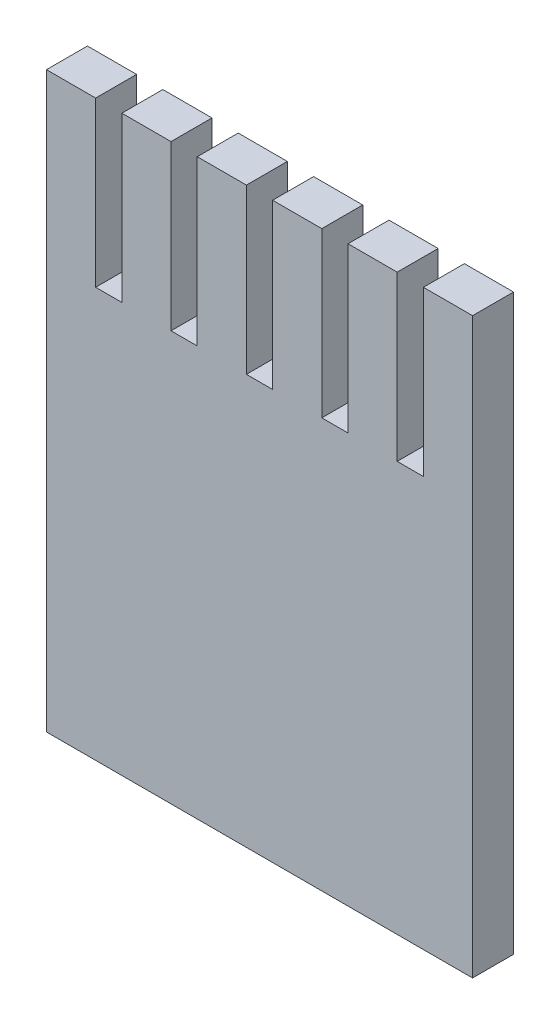
ISO-10303-21;
HEADER;
FILE_DESCRIPTION(('STEP AP214'),'2;1');
FILE_NAME('part.step','',(''),(''),'','','');
FILE_SCHEMA(('AUTOMOTIVE_DESIGN { 1 0 10303 214 1 1 1 1 }'));
ENDSEC;
DATA;
#1=APPLICATION_CONTEXT('core data for automotive mechanical design processes');
#2=APPLICATION_PROTOCOL_DEFINITION('international standard','automotive_design',2000,#1);
#3=PRODUCT_CONTEXT('',#1,'mechanical');
#4=PRODUCT('Part','Part','',(#3));
#5=PRODUCT_RELATED_PRODUCT_CATEGORY('part','',(#4));
#6=PRODUCT_DEFINITION_FORMATION('','',#4);
#7=PRODUCT_DEFINITION_CONTEXT('part definition',#1,'design');
#8=PRODUCT_DEFINITION('design','',#6,#7);
#9=PRODUCT_DEFINITION_SHAPE('','',#8);
#10=(LENGTH_UNIT() NAMED_UNIT(*) SI_UNIT(.MILLI.,.METRE.));
#11=(NAMED_UNIT(*) PLANE_ANGLE_UNIT() SI_UNIT($,.RADIAN.));
#12=(NAMED_UNIT(*) SI_UNIT($,.STERADIAN.) SOLID_ANGLE_UNIT());
#13=UNCERTAINTY_MEASURE_WITH_UNIT(LENGTH_MEASURE(1.E-05),#10,'distance_accuracy_value','');
#14=(GEOMETRIC_REPRESENTATION_CONTEXT(3) GLOBAL_UNCERTAINTY_ASSIGNED_CONTEXT((#13)) GLOBAL_UNIT_ASSIGNED_CONTEXT((#10,
#11,#12)) REPRESENTATION_CONTEXT('',''));
#15=CARTESIAN_POINT('',(0.,0.,0.));
#16=DIRECTION('',(0.,0.,1.));
#17=DIRECTION('',(1.,0.,0.));
#18=AXIS2_PLACEMENT_3D('',#15,#16,#17);
#19=CARTESIAN_POINT('',(0.,0.,2.5));
#20=DIRECTION('',(0.,1.,0.));
#21=DIRECTION('',(0.,0.,1.));
#22=AXIS2_PLACEMENT_3D('',#19,#20,#21);
#23=PLANE('',#22);
#24=DIRECTION('',(1.,0.,0.));
#25=VECTOR('',#24,1.);
#26=CARTESIAN_POINT('',(0.,0.,0.));
#27=LINE('',#26,#25);
#28=CARTESIAN_POINT('',(0.,0.,0.));
#29=VERTEX_POINT('',#28);
#30=CARTESIAN_POINT('',(26.,0.,0.));
#31=VERTEX_POINT('',#30);
#32=EDGE_CURVE('E238',#29,#31,#27,.T.);
#33=ORIENTED_EDGE('',*,*,#32,.T.);
#34=DIRECTION('',(0.,0.,-1.));
#35=VECTOR('',#34,1.);
#36=CARTESIAN_POINT('',(26.,0.,2.5));
#37=LINE('',#36,#35);
#38=CARTESIAN_POINT('',(26.,0.,2.5));
#39=VERTEX_POINT('',#38);
#40=EDGE_CURVE('E11',#39,#31,#37,.T.);
#41=ORIENTED_EDGE('',*,*,#40,.F.);
#42=DIRECTION('',(1.,0.,0.));
#43=VECTOR('',#42,1.);
#44=CARTESIAN_POINT('',(0.,0.,2.5));
#45=LINE('',#44,#43);
#46=CARTESIAN_POINT('',(0.,0.,2.5));
#47=VERTEX_POINT('',#46);
#48=EDGE_CURVE('E318',#47,#39,#45,.T.);
#49=ORIENTED_EDGE('',*,*,#48,.F.);
#50=DIRECTION('',(0.,0.,-1.));
#51=VECTOR('',#50,1.);
#52=CARTESIAN_POINT('',(0.,0.,2.5));
#53=LINE('',#52,#51);
#54=EDGE_CURVE('E58',#47,#29,#53,.T.);
#55=ORIENTED_EDGE('',*,*,#54,.T.);
#56=EDGE_LOOP('',(#33,#41,#49,#55));
#57=FACE_BOUND('',#56,.T.);
#58=ADVANCED_FACE('F41',(#57),#23,.F.);
#59=CARTESIAN_POINT('',(26.,0.,2.5));
#60=DIRECTION('',(-1.,0.,0.));
#61=DIRECTION('',(0.,0.,1.));
#62=AXIS2_PLACEMENT_3D('',#59,#60,#61);
#63=PLANE('',#62);
#64=DIRECTION('',(0.,1.,0.));
#65=VECTOR('',#64,1.);
#66=CARTESIAN_POINT('',(26.,0.,0.));
#67=LINE('',#66,#65);
#68=CARTESIAN_POINT('',(26.,35.,0.));
#69=VERTEX_POINT('',#68);
#70=EDGE_CURVE('E241',#31,#69,#67,.T.);
#71=ORIENTED_EDGE('',*,*,#70,.T.);
#72=DIRECTION('',(0.,0.,-1.));
#73=VECTOR('',#72,1.);
#74=CARTESIAN_POINT('',(26.,35.,2.5));
#75=LINE('',#74,#73);
#76=CARTESIAN_POINT('',(26.,35.,2.5));
#77=VERTEX_POINT('',#76);
#78=EDGE_CURVE('E50',#77,#69,#75,.T.);
#79=ORIENTED_EDGE('',*,*,#78,.F.);
#80=DIRECTION('',(0.,1.,0.));
#81=VECTOR('',#80,1.);
#82=CARTESIAN_POINT('',(26.,0.,2.5));
#83=LINE('',#82,#81);
#84=EDGE_CURVE('E144',#39,#77,#83,.T.);
#85=ORIENTED_EDGE('',*,*,#84,.F.);
#86=ORIENTED_EDGE('',*,*,#40,.T.);
#87=EDGE_LOOP('',(#71,#79,#85,#86));
#88=FACE_BOUND('',#87,.T.);
#89=ADVANCED_FACE('F385',(#88),#63,.F.);
#90=CARTESIAN_POINT('',(0.,35.,2.5));
#91=DIRECTION('',(0.,1.,0.));
#92=DIRECTION('',(0.,0.,1.));
#93=AXIS2_PLACEMENT_3D('',#90,#91,#92);
#94=PLANE('',#93);
#95=DIRECTION('',(1.,0.,0.));
#96=VECTOR('',#95,1.);
#97=CARTESIAN_POINT('',(0.,35.,0.));
#98=LINE('',#97,#96);
#99=CARTESIAN_POINT('',(23.,35.,0.));
#100=VERTEX_POINT('',#99);
#101=EDGE_CURVE('E245',#100,#69,#98,.T.);
#102=ORIENTED_EDGE('',*,*,#101,.F.);
#103=DIRECTION('',(0.,0.,-1.));
#104=VECTOR('',#103,1.);
#105=CARTESIAN_POINT('',(23.,35.,2.5));
#106=LINE('',#105,#104);
#107=CARTESIAN_POINT('',(23.,35.,2.5));
#108=VERTEX_POINT('',#107);
#109=EDGE_CURVE('E376',#108,#100,#106,.T.);
#110=ORIENTED_EDGE('',*,*,#109,.F.);
#111=DIRECTION('',(1.,0.,0.));
#112=VECTOR('',#111,1.);
#113=CARTESIAN_POINT('',(0.,35.,2.5));
#114=LINE('',#113,#112);
#115=EDGE_CURVE('E384',#108,#77,#114,.T.);
#116=ORIENTED_EDGE('',*,*,#115,.T.);
#117=ORIENTED_EDGE('',*,*,#78,.T.);
#118=EDGE_LOOP('',(#102,#110,#116,#117));
#119=FACE_BOUND('',#118,.T.);
#120=ADVANCED_FACE('F382',(#119),#94,.T.);
#121=CARTESIAN_POINT('',(23.,0.,2.5));
#122=DIRECTION('',(1.,0.,0.));
#123=DIRECTION('',(0.,0.,-1.));
#124=AXIS2_PLACEMENT_3D('',#121,#122,#123);
#125=PLANE('',#124);
#126=DIRECTION('',(0.,-1.,0.));
#127=VECTOR('',#126,1.);
#128=CARTESIAN_POINT('',(23.,0.,0.));
#129=LINE('',#128,#127);
#130=CARTESIAN_POINT('',(23.,25.,0.));
#131=VERTEX_POINT('',#130);
#132=EDGE_CURVE('E249',#100,#131,#129,.T.);
#133=ORIENTED_EDGE('',*,*,#132,.T.);
#134=DIRECTION('',(0.,0.,-1.));
#135=VECTOR('',#134,1.);
#136=CARTESIAN_POINT('',(23.,25.,2.5));
#137=LINE('',#136,#135);
#138=CARTESIAN_POINT('',(23.,25.,2.5));
#139=VERTEX_POINT('',#138);
#140=EDGE_CURVE('E373',#139,#131,#137,.T.);
#141=ORIENTED_EDGE('',*,*,#140,.F.);
#142=DIRECTION('',(0.,-1.,0.));
#143=VECTOR('',#142,1.);
#144=CARTESIAN_POINT('',(23.,0.,2.5));
#145=LINE('',#144,#143);
#146=EDGE_CURVE('E396',#108,#139,#145,.T.);
#147=ORIENTED_EDGE('',*,*,#146,.F.);
#148=ORIENTED_EDGE('',*,*,#109,.T.);
#149=EDGE_LOOP('',(#133,#141,#147,#148));
#150=FACE_BOUND('',#149,.T.);
#151=ADVANCED_FACE('F393',(#150),#125,.F.);
#152=CARTESIAN_POINT('',(0.,25.,2.5));
#153=DIRECTION('',(0.,1.,0.));
#154=DIRECTION('',(0.,0.,1.));
#155=AXIS2_PLACEMENT_3D('',#152,#153,#154);
#156=PLANE('',#155);
#157=DIRECTION('',(1.,0.,0.));
#158=VECTOR('',#157,1.);
#159=CARTESIAN_POINT('',(0.,25.,0.));
#160=LINE('',#159,#158);
#161=CARTESIAN_POINT('',(21.4,25.,0.));
#162=VERTEX_POINT('',#161);
#163=EDGE_CURVE('E253',#162,#131,#160,.T.);
#164=ORIENTED_EDGE('',*,*,#163,.F.);
#165=DIRECTION('',(0.,0.,-1.));
#166=VECTOR('',#165,1.);
#167=CARTESIAN_POINT('',(21.4,25.,2.5));
#168=LINE('',#167,#166);
#169=CARTESIAN_POINT('',(21.4,25.,2.5));
#170=VERTEX_POINT('',#169);
#171=EDGE_CURVE('E370',#170,#162,#168,.T.);
#172=ORIENTED_EDGE('',*,*,#171,.F.);
#173=DIRECTION('',(1.,0.,0.));
#174=VECTOR('',#173,1.);
#175=CARTESIAN_POINT('',(0.,25.,2.5));
#176=LINE('',#175,#174);
#177=EDGE_CURVE('E399',#170,#139,#176,.T.);
#178=ORIENTED_EDGE('',*,*,#177,.T.);
#179=ORIENTED_EDGE('',*,*,#140,.T.);
#180=EDGE_LOOP('',(#164,#172,#178,#179));
#181=FACE_BOUND('',#180,.T.);
#182=ADVANCED_FACE('F550',(#181),#156,.T.);
#183=CARTESIAN_POINT('',(21.4,0.,2.5));
#184=DIRECTION('',(1.,0.,0.));
#185=DIRECTION('',(0.,1.,0.));
#186=AXIS2_PLACEMENT_3D('',#183,#184,#185);
#187=PLANE('',#186);
#188=DIRECTION('',(0.,-1.,0.));
#189=VECTOR('',#188,1.);
#190=CARTESIAN_POINT('',(21.4,0.,0.));
#191=LINE('',#190,#189);
#192=CARTESIAN_POINT('',(21.4,35.,0.));
#193=VERTEX_POINT('',#192);
#194=EDGE_CURVE('E257',#193,#162,#191,.T.);
#195=ORIENTED_EDGE('',*,*,#194,.F.);
#196=DIRECTION('',(0.,0.,-1.));
#197=VECTOR('',#196,1.);
#198=CARTESIAN_POINT('',(21.4,35.,2.5));
#199=LINE('',#198,#197);
#200=CARTESIAN_POINT('',(21.4,35.,2.5));
#201=VERTEX_POINT('',#200);
#202=EDGE_CURVE('E367',#201,#193,#199,.T.);
#203=ORIENTED_EDGE('',*,*,#202,.F.);
#204=DIRECTION('',(0.,-1.,0.));
#205=VECTOR('',#204,1.);
#206=CARTESIAN_POINT('',(21.4,0.,2.5));
#207=LINE('',#206,#205);
#208=EDGE_CURVE('E409',#201,#170,#207,.T.);
#209=ORIENTED_EDGE('',*,*,#208,.T.);
#210=ORIENTED_EDGE('',*,*,#171,.T.);
#211=EDGE_LOOP('',(#195,#203,#209,#210));
#212=FACE_BOUND('',#211,.T.);
#213=ADVANCED_FACE('F548',(#212),#187,.T.);
#214=CARTESIAN_POINT('',(0.,35.,2.5));
#215=DIRECTION('',(0.,1.,0.));
#216=DIRECTION('',(0.,0.,1.));
#217=AXIS2_PLACEMENT_3D('',#214,#215,#216);
#218=PLANE('',#217);
#219=DIRECTION('',(1.,0.,0.));
#220=VECTOR('',#219,1.);
#221=CARTESIAN_POINT('',(0.,35.,0.));
#222=LINE('',#221,#220);
#223=CARTESIAN_POINT('',(18.4,35.,0.));
#224=VERTEX_POINT('',#223);
#225=EDGE_CURVE('E263',#224,#193,#222,.T.);
#226=ORIENTED_EDGE('',*,*,#225,.F.);
#227=DIRECTION('',(0.,0.,-1.));
#228=VECTOR('',#227,1.);
#229=CARTESIAN_POINT('',(18.4,35.,2.5));
#230=LINE('',#229,#228);
#231=CARTESIAN_POINT('',(18.4,35.,2.5));
#232=VERTEX_POINT('',#231);
#233=EDGE_CURVE('E364',#232,#224,#230,.T.);
#234=ORIENTED_EDGE('',*,*,#233,.F.);
#235=DIRECTION('',(1.,0.,0.));
#236=VECTOR('',#235,1.);
#237=CARTESIAN_POINT('',(0.,35.,2.5));
#238=LINE('',#237,#236);
#239=EDGE_CURVE('E414',#232,#201,#238,.T.);
#240=ORIENTED_EDGE('',*,*,#239,.T.);
#241=ORIENTED_EDGE('',*,*,#202,.T.);
#242=EDGE_LOOP('',(#226,#234,#240,#241));
#243=FACE_BOUND('',#242,.T.);
#244=ADVANCED_FACE('F544',(#243),#218,.T.);
#245=CARTESIAN_POINT('',(18.4,0.,2.5));
#246=DIRECTION('',(1.,0.,0.));
#247=DIRECTION('',(0.,0.,-1.));
#248=AXIS2_PLACEMENT_3D('',#245,#246,#247);
#249=PLANE('',#248);
#250=DIRECTION('',(0.,-1.,0.));
#251=VECTOR('',#250,1.);
#252=CARTESIAN_POINT('',(18.4,0.,0.));
#253=LINE('',#252,#251);
#254=CARTESIAN_POINT('',(18.4,25.,0.));
#255=VERTEX_POINT('',#254);
#256=EDGE_CURVE('E267',#224,#255,#253,.T.);
#257=ORIENTED_EDGE('',*,*,#256,.T.);
#258=DIRECTION('',(0.,0.,-1.));
#259=VECTOR('',#258,1.);
#260=CARTESIAN_POINT('',(18.4,25.,2.5));
#261=LINE('',#260,#259);
#262=CARTESIAN_POINT('',(18.4,25.,2.5));
#263=VERTEX_POINT('',#262);
#264=EDGE_CURVE('E361',#263,#255,#261,.T.);
#265=ORIENTED_EDGE('',*,*,#264,.F.);
#266=DIRECTION('',(0.,-1.,0.));
#267=VECTOR('',#266,1.);
#268=CARTESIAN_POINT('',(18.4,0.,2.5));
#269=LINE('',#268,#267);
#270=EDGE_CURVE('E418',#232,#263,#269,.T.);
#271=ORIENTED_EDGE('',*,*,#270,.F.);
#272=ORIENTED_EDGE('',*,*,#233,.T.);
#273=EDGE_LOOP('',(#257,#265,#271,#272));
#274=FACE_BOUND('',#273,.T.);
#275=ADVANCED_FACE('F562',(#274),#249,.F.);
#276=CARTESIAN_POINT('',(16.8,25.,0.));
#277=VERTEX_POINT('',#276);
#278=EDGE_CURVE('E259',#277,#255,#160,.T.);
#279=ORIENTED_EDGE('',*,*,#278,.F.);
#280=DIRECTION('',(0.,0.,-1.));
#281=VECTOR('',#280,1.);
#282=CARTESIAN_POINT('',(16.8,25.,2.5));
#283=LINE('',#282,#281);
#284=CARTESIAN_POINT('',(16.8,25.,2.5));
#285=VERTEX_POINT('',#284);
#286=EDGE_CURVE('E358',#285,#277,#283,.T.);
#287=ORIENTED_EDGE('',*,*,#286,.F.);
#288=EDGE_CURVE('E410',#285,#263,#176,.T.);
#289=ORIENTED_EDGE('',*,*,#288,.T.);
#290=ORIENTED_EDGE('',*,*,#264,.T.);
#291=EDGE_LOOP('',(#279,#287,#289,#290));
#292=FACE_BOUND('',#291,.T.);
#293=ADVANCED_FACE('F472',(#292),#156,.T.);
#294=CARTESIAN_POINT('',(16.8,0.,2.5));
#295=DIRECTION('',(1.,0.,0.));
#296=DIRECTION('',(0.,1.,0.));
#297=AXIS2_PLACEMENT_3D('',#294,#295,#296);
#298=PLANE('',#297);
#299=DIRECTION('',(0.,-1.,0.));
#300=VECTOR('',#299,1.);
#301=CARTESIAN_POINT('',(16.8,0.,0.));
#302=LINE('',#301,#300);
#303=CARTESIAN_POINT('',(16.8,35.,0.));
#304=VERTEX_POINT('',#303);
#305=EDGE_CURVE('E271',#304,#277,#302,.T.);
#306=ORIENTED_EDGE('',*,*,#305,.F.);
#307=DIRECTION('',(0.,0.,-1.));
#308=VECTOR('',#307,1.);
#309=CARTESIAN_POINT('',(16.8,35.,2.5));
#310=LINE('',#309,#308);
#311=CARTESIAN_POINT('',(16.8,35.,2.5));
#312=VERTEX_POINT('',#311);
#313=EDGE_CURVE('E355',#312,#304,#310,.T.);
#314=ORIENTED_EDGE('',*,*,#313,.F.);
#315=DIRECTION('',(0.,-1.,0.));
#316=VECTOR('',#315,1.);
#317=CARTESIAN_POINT('',(16.8,0.,2.5));
#318=LINE('',#317,#316);
#319=EDGE_CURVE('E421',#312,#285,#318,.T.);
#320=ORIENTED_EDGE('',*,*,#319,.T.);
#321=ORIENTED_EDGE('',*,*,#286,.T.);
#322=EDGE_LOOP('',(#306,#314,#320,#321));
#323=FACE_BOUND('',#322,.T.);
#324=ADVANCED_FACE('F480',(#323),#298,.T.);
#325=CARTESIAN_POINT('',(0.,35.,2.5));
#326=DIRECTION('',(0.,1.,0.));
#327=DIRECTION('',(0.,0.,1.));
#328=AXIS2_PLACEMENT_3D('',#325,#326,#327);
#329=PLANE('',#328);
#330=DIRECTION('',(1.,0.,0.));
#331=VECTOR('',#330,1.);
#332=CARTESIAN_POINT('',(0.,35.,0.));
#333=LINE('',#332,#331);
#334=CARTESIAN_POINT('',(13.8,35.,0.));
#335=VERTEX_POINT('',#334);
#336=EDGE_CURVE('E275',#335,#304,#333,.T.);
#337=ORIENTED_EDGE('',*,*,#336,.F.);
#338=DIRECTION('',(0.,0.,-1.));
#339=VECTOR('',#338,1.);
#340=CARTESIAN_POINT('',(13.8,35.,2.5));
#341=LINE('',#340,#339);
#342=CARTESIAN_POINT('',(13.8,35.,2.5));
#343=VERTEX_POINT('',#342);
#344=EDGE_CURVE('E352',#343,#335,#341,.T.);
#345=ORIENTED_EDGE('',*,*,#344,.F.);
#346=DIRECTION('',(1.,0.,0.));
#347=VECTOR('',#346,1.);
#348=CARTESIAN_POINT('',(0.,35.,2.5));
#349=LINE('',#348,#347);
#350=EDGE_CURVE('E425',#343,#312,#349,.T.);
#351=ORIENTED_EDGE('',*,*,#350,.T.);
#352=ORIENTED_EDGE('',*,*,#313,.T.);
#353=EDGE_LOOP('',(#337,#345,#351,#352));
#354=FACE_BOUND('',#353,.T.);
#355=ADVANCED_FACE('F483',(#354),#329,.T.);
#356=CARTESIAN_POINT('',(13.8,0.,2.5));
#357=DIRECTION('',(1.,0.,0.));
#358=DIRECTION('',(0.,0.,-1.));
#359=AXIS2_PLACEMENT_3D('',#356,#357,#358);
#360=PLANE('',#359);
#361=DIRECTION('',(0.,-1.,0.));
#362=VECTOR('',#361,1.);
#363=CARTESIAN_POINT('',(13.8,0.,0.));
#364=LINE('',#363,#362);
#365=CARTESIAN_POINT('',(13.8,25.,0.));
#366=VERTEX_POINT('',#365);
#367=EDGE_CURVE('E279',#335,#366,#364,.T.);
#368=ORIENTED_EDGE('',*,*,#367,.T.);
#369=DIRECTION('',(0.,0.,-1.));
#370=VECTOR('',#369,1.);
#371=CARTESIAN_POINT('',(13.8,25.,2.5));
#372=LINE('',#371,#370);
#373=CARTESIAN_POINT('',(13.8,25.,2.5));
#374=VERTEX_POINT('',#373);
#375=EDGE_CURVE('E349',#374,#366,#372,.T.);
#376=ORIENTED_EDGE('',*,*,#375,.F.);
#377=DIRECTION('',(0.,-1.,0.));
#378=VECTOR('',#377,1.);
#379=CARTESIAN_POINT('',(13.8,0.,2.5));
#380=LINE('',#379,#378);
#381=EDGE_CURVE('E429',#343,#374,#380,.T.);
#382=ORIENTED_EDGE('',*,*,#381,.F.);
#383=ORIENTED_EDGE('',*,*,#344,.T.);
#384=EDGE_LOOP('',(#368,#376,#382,#383));
#385=FACE_BOUND('',#384,.T.);
#386=ADVANCED_FACE('F488',(#385),#360,.F.);
#387=CARTESIAN_POINT('',(12.2,25.,0.));
#388=VERTEX_POINT('',#387);
#389=EDGE_CURVE('E283',#388,#366,#160,.T.);
#390=ORIENTED_EDGE('',*,*,#389,.F.);
#391=DIRECTION('',(0.,0.,-1.));
#392=VECTOR('',#391,1.);
#393=CARTESIAN_POINT('',(12.2,25.,2.5));
#394=LINE('',#393,#392);
#395=CARTESIAN_POINT('',(12.2,25.,2.5));
#396=VERTEX_POINT('',#395);
#397=EDGE_CURVE('E346',#396,#388,#394,.T.);
#398=ORIENTED_EDGE('',*,*,#397,.F.);
#399=EDGE_CURVE('E432',#396,#374,#176,.T.);
#400=ORIENTED_EDGE('',*,*,#399,.T.);
#401=ORIENTED_EDGE('',*,*,#375,.T.);
#402=EDGE_LOOP('',(#390,#398,#400,#401));
#403=FACE_BOUND('',#402,.T.);
#404=ADVANCED_FACE('F492',(#403),#156,.T.);
#405=CARTESIAN_POINT('',(12.2,0.,2.5));
#406=DIRECTION('',(1.,0.,0.));
#407=DIRECTION('',(0.,1.,0.));
#408=AXIS2_PLACEMENT_3D('',#405,#406,#407);
#409=PLANE('',#408);
#410=DIRECTION('',(0.,-1.,0.));
#411=VECTOR('',#410,1.);
#412=CARTESIAN_POINT('',(12.2,0.,0.));
#413=LINE('',#412,#411);
#414=CARTESIAN_POINT('',(12.2,35.,0.));
#415=VERTEX_POINT('',#414);
#416=EDGE_CURVE('E284',#415,#388,#413,.T.);
#417=ORIENTED_EDGE('',*,*,#416,.F.);
#418=DIRECTION('',(0.,0.,-1.));
#419=VECTOR('',#418,1.);
#420=CARTESIAN_POINT('',(12.2,35.,2.5));
#421=LINE('',#420,#419);
#422=CARTESIAN_POINT('',(12.2,35.,2.5));
#423=VERTEX_POINT('',#422);
#424=EDGE_CURVE('E343',#423,#415,#421,.T.);
#425=ORIENTED_EDGE('',*,*,#424,.F.);
#426=DIRECTION('',(0.,-1.,0.));
#427=VECTOR('',#426,1.);
#428=CARTESIAN_POINT('',(12.2,0.,2.5));
#429=LINE('',#428,#427);
#430=EDGE_CURVE('E433',#423,#396,#429,.T.);
#431=ORIENTED_EDGE('',*,*,#430,.T.);
#432=ORIENTED_EDGE('',*,*,#397,.T.);
#433=EDGE_LOOP('',(#417,#425,#431,#432));
#434=FACE_BOUND('',#433,.T.);
#435=ADVANCED_FACE('F498',(#434),#409,.T.);
#436=CARTESIAN_POINT('',(0.,35.,2.5));
#437=DIRECTION('',(0.,1.,0.));
#438=DIRECTION('',(0.,0.,1.));
#439=AXIS2_PLACEMENT_3D('',#436,#437,#438);
#440=PLANE('',#439);
#441=DIRECTION('',(1.,0.,0.));
#442=VECTOR('',#441,1.);
#443=CARTESIAN_POINT('',(0.,35.,0.));
#444=LINE('',#443,#442);
#445=CARTESIAN_POINT('',(9.2,35.,0.));
#446=VERTEX_POINT('',#445);
#447=EDGE_CURVE('E288',#446,#415,#444,.T.);
#448=ORIENTED_EDGE('',*,*,#447,.F.);
#449=DIRECTION('',(0.,0.,-1.));
#450=VECTOR('',#449,1.);
#451=CARTESIAN_POINT('',(9.2,35.,2.5));
#452=LINE('',#451,#450);
#453=CARTESIAN_POINT('',(9.2,35.,2.5));
#454=VERTEX_POINT('',#453);
#455=EDGE_CURVE('E340',#454,#446,#452,.T.);
#456=ORIENTED_EDGE('',*,*,#455,.F.);
#457=DIRECTION('',(1.,0.,0.));
#458=VECTOR('',#457,1.);
#459=CARTESIAN_POINT('',(0.,35.,2.5));
#460=LINE('',#459,#458);
#461=EDGE_CURVE('E437',#454,#423,#460,.T.);
#462=ORIENTED_EDGE('',*,*,#461,.T.);
#463=ORIENTED_EDGE('',*,*,#424,.T.);
#464=EDGE_LOOP('',(#448,#456,#462,#463));
#465=FACE_BOUND('',#464,.T.);
#466=ADVANCED_FACE('F501',(#465),#440,.T.);
#467=CARTESIAN_POINT('',(9.2,0.,2.5));
#468=DIRECTION('',(1.,0.,0.));
#469=DIRECTION('',(0.,0.,-1.));
#470=AXIS2_PLACEMENT_3D('',#467,#468,#469);
#471=PLANE('',#470);
#472=DIRECTION('',(0.,-1.,0.));
#473=VECTOR('',#472,1.);
#474=CARTESIAN_POINT('',(9.2,0.,0.));
#475=LINE('',#474,#473);
#476=CARTESIAN_POINT('',(9.2,25.,0.));
#477=VERTEX_POINT('',#476);
#478=EDGE_CURVE('E292',#446,#477,#475,.T.);
#479=ORIENTED_EDGE('',*,*,#478,.T.);
#480=DIRECTION('',(0.,0.,-1.));
#481=VECTOR('',#480,1.);
#482=CARTESIAN_POINT('',(9.2,25.,2.5));
#483=LINE('',#482,#481);
#484=CARTESIAN_POINT('',(9.2,25.,2.5));
#485=VERTEX_POINT('',#484);
#486=EDGE_CURVE('E337',#485,#477,#483,.T.);
#487=ORIENTED_EDGE('',*,*,#486,.F.);
#488=DIRECTION('',(0.,-1.,0.));
#489=VECTOR('',#488,1.);
#490=CARTESIAN_POINT('',(9.2,0.,2.5));
#491=LINE('',#490,#489);
#492=EDGE_CURVE('E441',#454,#485,#491,.T.);
#493=ORIENTED_EDGE('',*,*,#492,.F.);
#494=ORIENTED_EDGE('',*,*,#455,.T.);
#495=EDGE_LOOP('',(#479,#487,#493,#494));
#496=FACE_BOUND('',#495,.T.);
#497=ADVANCED_FACE('F505',(#496),#471,.F.);
#498=CARTESIAN_POINT('',(7.6,25.,0.));
#499=VERTEX_POINT('',#498);
#500=EDGE_CURVE('E296',#499,#477,#160,.T.);
#501=ORIENTED_EDGE('',*,*,#500,.F.);
#502=DIRECTION('',(0.,0.,-1.));
#503=VECTOR('',#502,1.);
#504=CARTESIAN_POINT('',(7.6,25.,2.5));
#505=LINE('',#504,#503);
#506=CARTESIAN_POINT('',(7.6,25.,2.5));
#507=VERTEX_POINT('',#506);
#508=EDGE_CURVE('E334',#507,#499,#505,.T.);
#509=ORIENTED_EDGE('',*,*,#508,.F.);
#510=EDGE_CURVE('E444',#507,#485,#176,.T.);
#511=ORIENTED_EDGE('',*,*,#510,.T.);
#512=ORIENTED_EDGE('',*,*,#486,.T.);
#513=EDGE_LOOP('',(#501,#509,#511,#512));
#514=FACE_BOUND('',#513,.T.);
#515=ADVANCED_FACE('F564',(#514),#156,.T.);
#516=CARTESIAN_POINT('',(7.6,0.,2.5));
#517=DIRECTION('',(1.,0.,0.));
#518=DIRECTION('',(0.,1.,0.));
#519=AXIS2_PLACEMENT_3D('',#516,#517,#518);
#520=PLANE('',#519);
#521=DIRECTION('',(0.,-1.,0.));
#522=VECTOR('',#521,1.);
#523=CARTESIAN_POINT('',(7.6,0.,0.));
#524=LINE('',#523,#522);
#525=CARTESIAN_POINT('',(7.6,35.,0.));
#526=VERTEX_POINT('',#525);
#527=EDGE_CURVE('E297',#526,#499,#524,.T.);
#528=ORIENTED_EDGE('',*,*,#527,.F.);
#529=DIRECTION('',(0.,0.,-1.));
#530=VECTOR('',#529,1.);
#531=CARTESIAN_POINT('',(7.6,35.,2.5));
#532=LINE('',#531,#530);
#533=CARTESIAN_POINT('',(7.6,35.,2.5));
#534=VERTEX_POINT('',#533);
#535=EDGE_CURVE('E331',#534,#526,#532,.T.);
#536=ORIENTED_EDGE('',*,*,#535,.F.);
#537=DIRECTION('',(0.,-1.,0.));
#538=VECTOR('',#537,1.);
#539=CARTESIAN_POINT('',(7.6,0.,2.5));
#540=LINE('',#539,#538);
#541=EDGE_CURVE('E445',#534,#507,#540,.T.);
#542=ORIENTED_EDGE('',*,*,#541,.T.);
#543=ORIENTED_EDGE('',*,*,#508,.T.);
#544=EDGE_LOOP('',(#528,#536,#542,#543));
#545=FACE_BOUND('',#544,.T.);
#546=ADVANCED_FACE('F509',(#545),#520,.T.);
#547=CARTESIAN_POINT('',(0.,35.,2.5));
#548=DIRECTION('',(0.,1.,0.));
#549=DIRECTION('',(0.,0.,1.));
#550=AXIS2_PLACEMENT_3D('',#547,#548,#549);
#551=PLANE('',#550);
#552=DIRECTION('',(1.,0.,0.));
#553=VECTOR('',#552,1.);
#554=CARTESIAN_POINT('',(0.,35.,0.));
#555=LINE('',#554,#553);
#556=CARTESIAN_POINT('',(4.6,35.,0.));
#557=VERTEX_POINT('',#556);
#558=EDGE_CURVE('E301',#557,#526,#555,.T.);
#559=ORIENTED_EDGE('',*,*,#558,.F.);
#560=DIRECTION('',(0.,0.,-1.));
#561=VECTOR('',#560,1.);
#562=CARTESIAN_POINT('',(4.6,35.,2.5));
#563=LINE('',#562,#561);
#564=CARTESIAN_POINT('',(4.6,35.,2.5));
#565=VERTEX_POINT('',#564);
#566=EDGE_CURVE('E328',#565,#557,#563,.T.);
#567=ORIENTED_EDGE('',*,*,#566,.F.);
#568=DIRECTION('',(1.,0.,0.));
#569=VECTOR('',#568,1.);
#570=CARTESIAN_POINT('',(0.,35.,2.5));
#571=LINE('',#570,#569);
#572=EDGE_CURVE('E449',#565,#534,#571,.T.);
#573=ORIENTED_EDGE('',*,*,#572,.T.);
#574=ORIENTED_EDGE('',*,*,#535,.T.);
#575=EDGE_LOOP('',(#559,#567,#573,#574));
#576=FACE_BOUND('',#575,.T.);
#577=ADVANCED_FACE('F513',(#576),#551,.T.);
#578=CARTESIAN_POINT('',(4.6,0.,2.5));
#579=DIRECTION('',(1.,0.,0.));
#580=DIRECTION('',(0.,0.,-1.));
#581=AXIS2_PLACEMENT_3D('',#578,#579,#580);
#582=PLANE('',#581);
#583=DIRECTION('',(0.,-1.,0.));
#584=VECTOR('',#583,1.);
#585=CARTESIAN_POINT('',(4.6,0.,0.));
#586=LINE('',#585,#584);
#587=CARTESIAN_POINT('',(4.6,25.,0.));
#588=VERTEX_POINT('',#587);
#589=EDGE_CURVE('E305',#557,#588,#586,.T.);
#590=ORIENTED_EDGE('',*,*,#589,.T.);
#591=DIRECTION('',(0.,0.,-1.));
#592=VECTOR('',#591,1.);
#593=CARTESIAN_POINT('',(4.6,25.,2.5));
#594=LINE('',#593,#592);
#595=CARTESIAN_POINT('',(4.6,25.,2.5));
#596=VERTEX_POINT('',#595);
#597=EDGE_CURVE('E325',#596,#588,#594,.T.);
#598=ORIENTED_EDGE('',*,*,#597,.F.);
#599=DIRECTION('',(0.,-1.,0.));
#600=VECTOR('',#599,1.);
#601=CARTESIAN_POINT('',(4.6,0.,2.5));
#602=LINE('',#601,#600);
#603=EDGE_CURVE('E452',#565,#596,#602,.T.);
#604=ORIENTED_EDGE('',*,*,#603,.F.);
#605=ORIENTED_EDGE('',*,*,#566,.T.);
#606=EDGE_LOOP('',(#590,#598,#604,#605));
#607=FACE_BOUND('',#606,.T.);
#608=ADVANCED_FACE('F516',(#607),#582,.F.);
#609=CARTESIAN_POINT('',(3.,25.,0.));
#610=VERTEX_POINT('',#609);
#611=EDGE_CURVE('E258',#610,#588,#160,.T.);
#612=ORIENTED_EDGE('',*,*,#611,.F.);
#613=DIRECTION('',(0.,0.,-1.));
#614=VECTOR('',#613,1.);
#615=CARTESIAN_POINT('',(3.,25.,2.5));
#616=LINE('',#615,#614);
#617=CARTESIAN_POINT('',(3.,25.,2.5));
#618=VERTEX_POINT('',#617);
#619=EDGE_CURVE('E218',#618,#610,#616,.T.);
#620=ORIENTED_EDGE('',*,*,#619,.F.);
#621=EDGE_CURVE('E227',#618,#596,#176,.T.);
#622=ORIENTED_EDGE('',*,*,#621,.T.);
#623=ORIENTED_EDGE('',*,*,#597,.T.);
#624=EDGE_LOOP('',(#612,#620,#622,#623));
#625=FACE_BOUND('',#624,.T.);
#626=ADVANCED_FACE('F519',(#625),#156,.T.);
#627=CARTESIAN_POINT('',(3.,0.,2.5));
#628=DIRECTION('',(1.,0.,0.));
#629=DIRECTION('',(0.,1.,0.));
#630=AXIS2_PLACEMENT_3D('',#627,#628,#629);
#631=PLANE('',#630);
#632=DIRECTION('',(0.,-1.,0.));
#633=VECTOR('',#632,1.);
#634=CARTESIAN_POINT('',(3.,0.,0.));
#635=LINE('',#634,#633);
#636=CARTESIAN_POINT('',(3.,35.,0.));
#637=VERTEX_POINT('',#636);
#638=EDGE_CURVE('E213',#637,#610,#635,.T.);
#639=ORIENTED_EDGE('',*,*,#638,.F.);
#640=DIRECTION('',(0.,0.,-1.));
#641=VECTOR('',#640,1.);
#642=CARTESIAN_POINT('',(3.,35.,2.5));
#643=LINE('',#642,#641);
#644=CARTESIAN_POINT('',(3.,35.,2.5));
#645=VERTEX_POINT('',#644);
#646=EDGE_CURVE('E208',#645,#637,#643,.T.);
#647=ORIENTED_EDGE('',*,*,#646,.F.);
#648=DIRECTION('',(0.,-1.,0.));
#649=VECTOR('',#648,1.);
#650=CARTESIAN_POINT('',(3.,0.,2.5));
#651=LINE('',#650,#649);
#652=EDGE_CURVE('E211',#645,#618,#651,.T.);
#653=ORIENTED_EDGE('',*,*,#652,.T.);
#654=ORIENTED_EDGE('',*,*,#619,.T.);
#655=EDGE_LOOP('',(#639,#647,#653,#654));
#656=FACE_BOUND('',#655,.T.);
#657=ADVANCED_FACE('F210',(#656),#631,.T.);
#658=CARTESIAN_POINT('',(0.,35.,2.5));
#659=DIRECTION('',(0.,1.,0.));
#660=DIRECTION('',(0.,0.,1.));
#661=AXIS2_PLACEMENT_3D('',#658,#659,#660);
#662=PLANE('',#661);
#663=DIRECTION('',(1.,0.,0.));
#664=VECTOR('',#663,1.);
#665=CARTESIAN_POINT('',(0.,35.,0.));
#666=LINE('',#665,#664);
#667=CARTESIAN_POINT('',(0.,35.,0.));
#668=VERTEX_POINT('',#667);
#669=EDGE_CURVE('E311',#668,#637,#666,.T.);
#670=ORIENTED_EDGE('',*,*,#669,.F.);
#671=DIRECTION('',(0.,0.,-1.));
#672=VECTOR('',#671,1.);
#673=CARTESIAN_POINT('',(0.,35.,2.5));
#674=LINE('',#673,#672);
#675=CARTESIAN_POINT('',(0.,35.,2.5));
#676=VERTEX_POINT('',#675);
#677=EDGE_CURVE('E132',#676,#668,#674,.T.);
#678=ORIENTED_EDGE('',*,*,#677,.F.);
#679=DIRECTION('',(1.,0.,0.));
#680=VECTOR('',#679,1.);
#681=CARTESIAN_POINT('',(0.,35.,2.5));
#682=LINE('',#681,#680);
#683=EDGE_CURVE('E225',#676,#645,#682,.T.);
#684=ORIENTED_EDGE('',*,*,#683,.T.);
#685=ORIENTED_EDGE('',*,*,#646,.T.);
#686=EDGE_LOOP('',(#670,#678,#684,#685));
#687=FACE_BOUND('',#686,.T.);
#688=ADVANCED_FACE('F230',(#687),#662,.T.);
#689=CARTESIAN_POINT('',(0.,0.,2.5));
#690=DIRECTION('',(-1.,0.,0.));
#691=DIRECTION('',(0.,0.,1.));
#692=AXIS2_PLACEMENT_3D('',#689,#690,#691);
#693=PLANE('',#692);
#694=DIRECTION('',(0.,1.,0.));
#695=VECTOR('',#694,1.);
#696=CARTESIAN_POINT('',(0.,0.,0.));
#697=LINE('',#696,#695);
#698=EDGE_CURVE('E314',#29,#668,#697,.T.);
#699=ORIENTED_EDGE('',*,*,#698,.F.);
#700=ORIENTED_EDGE('',*,*,#54,.F.);
#701=DIRECTION('',(0.,1.,0.));
#702=VECTOR('',#701,1.);
#703=CARTESIAN_POINT('',(0.,0.,2.5));
#704=LINE('',#703,#702);
#705=EDGE_CURVE('E232',#47,#676,#704,.T.);
#706=ORIENTED_EDGE('',*,*,#705,.T.);
#707=ORIENTED_EDGE('',*,*,#677,.T.);
#708=EDGE_LOOP('',(#699,#700,#706,#707));
#709=FACE_BOUND('',#708,.T.);
#710=ADVANCED_FACE('F521',(#709),#693,.T.);
#711=CARTESIAN_POINT('',(0.,0.,2.5));
#712=DIRECTION('',(0.,0.,1.));
#713=DIRECTION('',(1.,0.,0.));
#714=AXIS2_PLACEMENT_3D('',#711,#712,#713);
#715=PLANE('',#714);
#716=ORIENTED_EDGE('',*,*,#48,.T.);
#717=ORIENTED_EDGE('',*,*,#84,.T.);
#718=ORIENTED_EDGE('',*,*,#115,.F.);
#719=ORIENTED_EDGE('',*,*,#146,.T.);
#720=ORIENTED_EDGE('',*,*,#177,.F.);
#721=ORIENTED_EDGE('',*,*,#208,.F.);
#722=ORIENTED_EDGE('',*,*,#239,.F.);
#723=ORIENTED_EDGE('',*,*,#270,.T.);
#724=ORIENTED_EDGE('',*,*,#288,.F.);
#725=ORIENTED_EDGE('',*,*,#319,.F.);
#726=ORIENTED_EDGE('',*,*,#350,.F.);
#727=ORIENTED_EDGE('',*,*,#381,.T.);
#728=ORIENTED_EDGE('',*,*,#399,.F.);
#729=ORIENTED_EDGE('',*,*,#430,.F.);
#730=ORIENTED_EDGE('',*,*,#461,.F.);
#731=ORIENTED_EDGE('',*,*,#492,.T.);
#732=ORIENTED_EDGE('',*,*,#510,.F.);
#733=ORIENTED_EDGE('',*,*,#541,.F.);
#734=ORIENTED_EDGE('',*,*,#572,.F.);
#735=ORIENTED_EDGE('',*,*,#603,.T.);
#736=ORIENTED_EDGE('',*,*,#621,.F.);
#737=ORIENTED_EDGE('',*,*,#652,.F.);
#738=ORIENTED_EDGE('',*,*,#683,.F.);
#739=ORIENTED_EDGE('',*,*,#705,.F.);
#740=EDGE_LOOP('',(#716,#717,#718,#719,#720,#721,#722,#723,#724,#725,#726,#727,#728,#729,#730,
#731,#732,#733,#734,#735,#736,#737,#738,#739));
#741=FACE_BOUND('',#740,.T.);
#742=ADVANCED_FACE('F223',(#741),#715,.T.);
#743=CARTESIAN_POINT('',(0.,0.,0.));
#744=DIRECTION('',(0.,0.,1.));
#745=DIRECTION('',(1.,0.,0.));
#746=AXIS2_PLACEMENT_3D('',#743,#744,#745);
#747=PLANE('',#746);
#748=ORIENTED_EDGE('',*,*,#32,.F.);
#749=ORIENTED_EDGE('',*,*,#698,.T.);
#750=ORIENTED_EDGE('',*,*,#669,.T.);
#751=ORIENTED_EDGE('',*,*,#638,.T.);
#752=ORIENTED_EDGE('',*,*,#611,.T.);
#753=ORIENTED_EDGE('',*,*,#589,.F.);
#754=ORIENTED_EDGE('',*,*,#558,.T.);
#755=ORIENTED_EDGE('',*,*,#527,.T.);
#756=ORIENTED_EDGE('',*,*,#500,.T.);
#757=ORIENTED_EDGE('',*,*,#478,.F.);
#758=ORIENTED_EDGE('',*,*,#447,.T.);
#759=ORIENTED_EDGE('',*,*,#416,.T.);
#760=ORIENTED_EDGE('',*,*,#389,.T.);
#761=ORIENTED_EDGE('',*,*,#367,.F.);
#762=ORIENTED_EDGE('',*,*,#336,.T.);
#763=ORIENTED_EDGE('',*,*,#305,.T.);
#764=ORIENTED_EDGE('',*,*,#278,.T.);
#765=ORIENTED_EDGE('',*,*,#256,.F.);
#766=ORIENTED_EDGE('',*,*,#225,.T.);
#767=ORIENTED_EDGE('',*,*,#194,.T.);
#768=ORIENTED_EDGE('',*,*,#163,.T.);
#769=ORIENTED_EDGE('',*,*,#132,.F.);
#770=ORIENTED_EDGE('',*,*,#101,.T.);
#771=ORIENTED_EDGE('',*,*,#70,.F.);
#772=EDGE_LOOP('',(#748,#749,#750,#751,#752,#753,#754,#755,#756,#757,#758,#759,#760,#761,#762,
#763,#764,#765,#766,#767,#768,#769,#770,#771));
#773=FACE_BOUND('',#772,.T.);
#774=ADVANCED_FACE('F389',(#773),#747,.F.);
#775=CLOSED_SHELL('',(#58,#89,#120,#151,#182,#213,#244,#275,#293,#324,#355,#386,#404,#435,#466,
#497,#515,#546,#577,#608,#626,#657,#688,#710,#742,#774));
#776=MANIFOLD_SOLID_BREP('B2',#775);
#777=ADVANCED_BREP_SHAPE_REPRESENTATION('',(#18,#776),#14);
#778=SHAPE_DEFINITION_REPRESENTATION(#9,#777);
ENDSEC;
END-ISO-10303-21;
